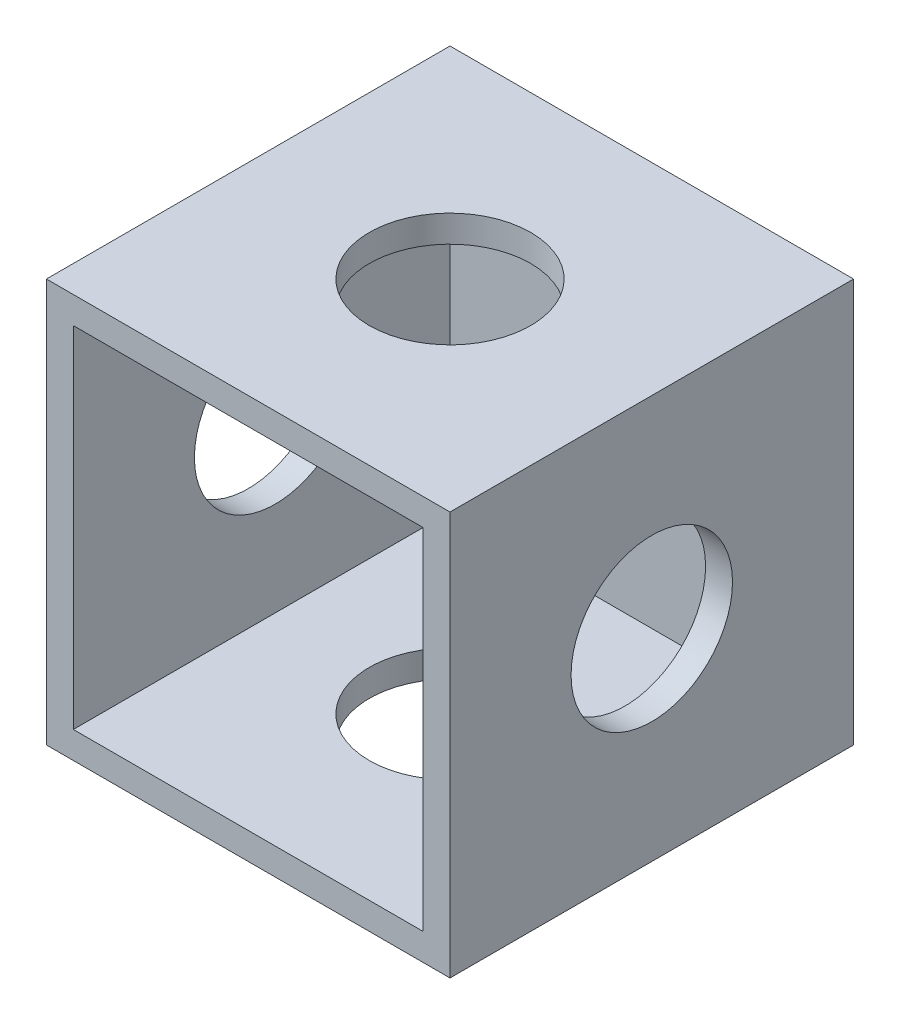
ISO-10303-21;
HEADER;
FILE_DESCRIPTION(('STEP AP214'),'2;1');
FILE_NAME('part.step','',(''),(''),'','','');
FILE_SCHEMA(('AUTOMOTIVE_DESIGN { 1 0 10303 214 1 1 1 1 }'));
ENDSEC;
DATA;
#1=APPLICATION_CONTEXT('core data for automotive mechanical design processes');
#2=APPLICATION_PROTOCOL_DEFINITION('international standard','automotive_design',2000,#1);
#3=PRODUCT_CONTEXT('',#1,'mechanical');
#4=PRODUCT('Part','Part','',(#3));
#5=PRODUCT_RELATED_PRODUCT_CATEGORY('part','',(#4));
#6=PRODUCT_DEFINITION_FORMATION('','',#4);
#7=PRODUCT_DEFINITION_CONTEXT('part definition',#1,'design');
#8=PRODUCT_DEFINITION('design','',#6,#7);
#9=PRODUCT_DEFINITION_SHAPE('','',#8);
#10=(LENGTH_UNIT() NAMED_UNIT(*) SI_UNIT(.MILLI.,.METRE.));
#11=(NAMED_UNIT(*) PLANE_ANGLE_UNIT() SI_UNIT($,.RADIAN.));
#12=(NAMED_UNIT(*) SI_UNIT($,.STERADIAN.) SOLID_ANGLE_UNIT());
#13=UNCERTAINTY_MEASURE_WITH_UNIT(LENGTH_MEASURE(1.E-05),#10,'distance_accuracy_value','');
#14=(GEOMETRIC_REPRESENTATION_CONTEXT(3) GLOBAL_UNCERTAINTY_ASSIGNED_CONTEXT((#13)) GLOBAL_UNIT_ASSIGNED_CONTEXT((#10,
#11,#12)) REPRESENTATION_CONTEXT('',''));
#15=CARTESIAN_POINT('',(0.,0.,0.));
#16=DIRECTION('',(0.,0.,1.));
#17=DIRECTION('',(1.,0.,0.));
#18=AXIS2_PLACEMENT_3D('',#15,#16,#17);
#19=CARTESIAN_POINT('',(0.,0.,30.));
#20=DIRECTION('',(0.,0.,-1.));
#21=DIRECTION('',(-1.,0.,0.));
#22=AXIS2_PLACEMENT_3D('',#19,#20,#21);
#23=PLANE('',#22);
#24=DIRECTION('',(1.,0.,0.));
#25=VECTOR('',#24,1.);
#26=CARTESIAN_POINT('',(15.,-15.,30.));
#27=LINE('',#26,#25);
#28=CARTESIAN_POINT('',(-15.,-15.,30.));
#29=VERTEX_POINT('',#28);
#30=CARTESIAN_POINT('',(15.,-15.,30.));
#31=VERTEX_POINT('',#30);
#32=EDGE_CURVE('E149',#29,#31,#27,.T.);
#33=ORIENTED_EDGE('',*,*,#32,.T.);
#34=DIRECTION('',(0.,1.,0.));
#35=VECTOR('',#34,1.);
#36=CARTESIAN_POINT('',(15.,-15.,30.));
#37=LINE('',#36,#35);
#38=CARTESIAN_POINT('',(15.,15.,30.));
#39=VERTEX_POINT('',#38);
#40=EDGE_CURVE('E93',#31,#39,#37,.T.);
#41=ORIENTED_EDGE('',*,*,#40,.T.);
#42=DIRECTION('',(-1.,0.,0.));
#43=VECTOR('',#42,1.);
#44=CARTESIAN_POINT('',(15.,15.,30.));
#45=LINE('',#44,#43);
#46=CARTESIAN_POINT('',(-15.,15.,30.));
#47=VERTEX_POINT('',#46);
#48=EDGE_CURVE('E152',#39,#47,#45,.T.);
#49=ORIENTED_EDGE('',*,*,#48,.T.);
#50=DIRECTION('',(0.,-1.,0.));
#51=VECTOR('',#50,1.);
#52=CARTESIAN_POINT('',(-15.,-15.,30.));
#53=LINE('',#52,#51);
#54=EDGE_CURVE('E65',#47,#29,#53,.T.);
#55=ORIENTED_EDGE('',*,*,#54,.T.);
#56=EDGE_LOOP('',(#33,#41,#49,#55));
#57=FACE_BOUND('',#56,.T.);
#58=DIRECTION('',(1.,0.,0.));
#59=VECTOR('',#58,1.);
#60=CARTESIAN_POINT('',(0.,-13.,30.));
#61=LINE('',#60,#59);
#62=CARTESIAN_POINT('',(-13.,-13.,30.));
#63=VERTEX_POINT('',#62);
#64=CARTESIAN_POINT('',(13.,-13.,30.));
#65=VERTEX_POINT('',#64);
#66=EDGE_CURVE('E138',#63,#65,#61,.T.);
#67=ORIENTED_EDGE('',*,*,#66,.F.);
#68=DIRECTION('',(0.,-1.,0.));
#69=VECTOR('',#68,1.);
#70=CARTESIAN_POINT('',(-13.,0.,30.));
#71=LINE('',#70,#69);
#72=CARTESIAN_POINT('',(-13.,13.,30.));
#73=VERTEX_POINT('',#72);
#74=EDGE_CURVE('E147',#73,#63,#71,.T.);
#75=ORIENTED_EDGE('',*,*,#74,.F.);
#76=DIRECTION('',(-1.,0.,0.));
#77=VECTOR('',#76,1.);
#78=CARTESIAN_POINT('',(0.,13.,30.));
#79=LINE('',#78,#77);
#80=CARTESIAN_POINT('',(13.,13.,30.));
#81=VERTEX_POINT('',#80);
#82=EDGE_CURVE('E145',#81,#73,#79,.T.);
#83=ORIENTED_EDGE('',*,*,#82,.F.);
#84=DIRECTION('',(0.,1.,0.));
#85=VECTOR('',#84,1.);
#86=CARTESIAN_POINT('',(13.,0.,30.));
#87=LINE('',#86,#85);
#88=EDGE_CURVE('E130',#65,#81,#87,.T.);
#89=ORIENTED_EDGE('',*,*,#88,.F.);
#90=EDGE_LOOP('',(#67,#75,#83,#89));
#91=FACE_BOUND('',#90,.T.);
#92=ADVANCED_FACE('F39',(#57,#91),#23,.F.);
#93=CARTESIAN_POINT('',(15.,-15.,30.));
#94=DIRECTION('',(0.,1.,0.));
#95=DIRECTION('',(0.,0.,1.));
#96=AXIS2_PLACEMENT_3D('',#93,#94,#95);
#97=PLANE('',#96);
#98=CARTESIAN_POINT('',(0.,-15.,15.));
#99=DIRECTION('',(0.,1.,0.));
#100=DIRECTION('',(0.,0.,1.));
#101=AXIS2_PLACEMENT_3D('',#98,#99,#100);
#102=CIRCLE('',#101,6.);
#103=CARTESIAN_POINT('',(0.,-15.,21.));
#104=VERTEX_POINT('',#103);
#105=EDGE_CURVE('E175',#104,#104,#102,.T.);
#106=ORIENTED_EDGE('',*,*,#105,.T.);
#107=EDGE_LOOP('',(#106));
#108=FACE_BOUND('',#107,.T.);
#109=DIRECTION('',(1.,0.,0.));
#110=VECTOR('',#109,1.);
#111=CARTESIAN_POINT('',(15.,-15.,0.));
#112=LINE('',#111,#110);
#113=CARTESIAN_POINT('',(-15.,-15.,0.));
#114=VERTEX_POINT('',#113);
#115=CARTESIAN_POINT('',(15.,-15.,0.));
#116=VERTEX_POINT('',#115);
#117=EDGE_CURVE('E156',#114,#116,#112,.T.);
#118=ORIENTED_EDGE('',*,*,#117,.T.);
#119=DIRECTION('',(0.,0.,-1.));
#120=VECTOR('',#119,1.);
#121=CARTESIAN_POINT('',(15.,-15.,30.));
#122=LINE('',#121,#120);
#123=EDGE_CURVE('E11',#31,#116,#122,.T.);
#124=ORIENTED_EDGE('',*,*,#123,.F.);
#125=ORIENTED_EDGE('',*,*,#32,.F.);
#126=DIRECTION('',(0.,0.,-1.));
#127=VECTOR('',#126,1.);
#128=CARTESIAN_POINT('',(-15.,-15.,30.));
#129=LINE('',#128,#127);
#130=EDGE_CURVE('E155',#29,#114,#129,.T.);
#131=ORIENTED_EDGE('',*,*,#130,.T.);
#132=EDGE_LOOP('',(#118,#124,#125,#131));
#133=FACE_BOUND('',#132,.T.);
#134=ADVANCED_FACE('F41',(#108,#133),#97,.F.);
#135=CARTESIAN_POINT('',(15.,-15.,30.));
#136=DIRECTION('',(-1.,0.,0.));
#137=DIRECTION('',(0.,0.,1.));
#138=AXIS2_PLACEMENT_3D('',#135,#136,#137);
#139=PLANE('',#138);
#140=CARTESIAN_POINT('',(15.,0.,15.));
#141=DIRECTION('',(1.,0.,0.));
#142=DIRECTION('',(0.,0.,-1.));
#143=AXIS2_PLACEMENT_3D('',#140,#141,#142);
#144=CIRCLE('',#143,6.);
#145=CARTESIAN_POINT('',(15.,0.,9.));
#146=VERTEX_POINT('',#145);
#147=EDGE_CURVE('E228',#146,#146,#144,.T.);
#148=ORIENTED_EDGE('',*,*,#147,.F.);
#149=EDGE_LOOP('',(#148));
#150=FACE_BOUND('',#149,.T.);
#151=DIRECTION('',(0.,1.,0.));
#152=VECTOR('',#151,1.);
#153=CARTESIAN_POINT('',(15.,-15.,0.));
#154=LINE('',#153,#152);
#155=CARTESIAN_POINT('',(15.,15.,0.));
#156=VERTEX_POINT('',#155);
#157=EDGE_CURVE('E159',#116,#156,#154,.T.);
#158=ORIENTED_EDGE('',*,*,#157,.T.);
#159=DIRECTION('',(0.,0.,-1.));
#160=VECTOR('',#159,1.);
#161=CARTESIAN_POINT('',(15.,15.,30.));
#162=LINE('',#161,#160);
#163=EDGE_CURVE('E48',#39,#156,#162,.T.);
#164=ORIENTED_EDGE('',*,*,#163,.F.);
#165=ORIENTED_EDGE('',*,*,#40,.F.);
#166=ORIENTED_EDGE('',*,*,#123,.T.);
#167=EDGE_LOOP('',(#158,#164,#165,#166));
#168=FACE_BOUND('',#167,.T.);
#169=ADVANCED_FACE('F206',(#150,#168),#139,.F.);
#170=CARTESIAN_POINT('',(15.,15.,30.));
#171=DIRECTION('',(0.,-1.,0.));
#172=DIRECTION('',(0.,0.,-1.));
#173=AXIS2_PLACEMENT_3D('',#170,#171,#172);
#174=PLANE('',#173);
#175=CARTESIAN_POINT('',(0.,15.,15.));
#176=DIRECTION('',(0.,1.,0.));
#177=DIRECTION('',(0.,0.,1.));
#178=AXIS2_PLACEMENT_3D('',#175,#176,#177);
#179=CIRCLE('',#178,6.);
#180=CARTESIAN_POINT('',(0.,15.,21.));
#181=VERTEX_POINT('',#180);
#182=EDGE_CURVE('E171',#181,#181,#179,.T.);
#183=ORIENTED_EDGE('',*,*,#182,.F.);
#184=EDGE_LOOP('',(#183));
#185=FACE_BOUND('',#184,.T.);
#186=DIRECTION('',(-1.,0.,0.));
#187=VECTOR('',#186,1.);
#188=CARTESIAN_POINT('',(15.,15.,0.));
#189=LINE('',#188,#187);
#190=CARTESIAN_POINT('',(-15.,15.,0.));
#191=VERTEX_POINT('',#190);
#192=EDGE_CURVE('E161',#156,#191,#189,.T.);
#193=ORIENTED_EDGE('',*,*,#192,.T.);
#194=DIRECTION('',(0.,0.,-1.));
#195=VECTOR('',#194,1.);
#196=CARTESIAN_POINT('',(-15.,15.,30.));
#197=LINE('',#196,#195);
#198=EDGE_CURVE('E165',#47,#191,#197,.T.);
#199=ORIENTED_EDGE('',*,*,#198,.F.);
#200=ORIENTED_EDGE('',*,*,#48,.F.);
#201=ORIENTED_EDGE('',*,*,#163,.T.);
#202=EDGE_LOOP('',(#193,#199,#200,#201));
#203=FACE_BOUND('',#202,.T.);
#204=ADVANCED_FACE('F217',(#185,#203),#174,.F.);
#205=CARTESIAN_POINT('',(-15.,-15.,30.));
#206=DIRECTION('',(1.,0.,0.));
#207=DIRECTION('',(0.,0.,-1.));
#208=AXIS2_PLACEMENT_3D('',#205,#206,#207);
#209=PLANE('',#208);
#210=CARTESIAN_POINT('',(-15.,0.,15.));
#211=DIRECTION('',(1.,0.,0.));
#212=DIRECTION('',(0.,0.,-1.));
#213=AXIS2_PLACEMENT_3D('',#210,#211,#212);
#214=CIRCLE('',#213,6.);
#215=CARTESIAN_POINT('',(-15.,0.,9.));
#216=VERTEX_POINT('',#215);
#217=EDGE_CURVE('E178',#216,#216,#214,.T.);
#218=ORIENTED_EDGE('',*,*,#217,.T.);
#219=EDGE_LOOP('',(#218));
#220=FACE_BOUND('',#219,.T.);
#221=DIRECTION('',(0.,-1.,0.));
#222=VECTOR('',#221,1.);
#223=CARTESIAN_POINT('',(-15.,-15.,0.));
#224=LINE('',#223,#222);
#225=EDGE_CURVE('E86',#191,#114,#224,.T.);
#226=ORIENTED_EDGE('',*,*,#225,.T.);
#227=ORIENTED_EDGE('',*,*,#130,.F.);
#228=ORIENTED_EDGE('',*,*,#54,.F.);
#229=ORIENTED_EDGE('',*,*,#198,.T.);
#230=EDGE_LOOP('',(#226,#227,#228,#229));
#231=FACE_BOUND('',#230,.T.);
#232=ADVANCED_FACE('F213',(#220,#231),#209,.F.);
#233=CARTESIAN_POINT('',(0.,0.,0.));
#234=DIRECTION('',(0.,0.,-1.));
#235=DIRECTION('',(-1.,0.,0.));
#236=AXIS2_PLACEMENT_3D('',#233,#234,#235);
#237=PLANE('',#236);
#238=ORIENTED_EDGE('',*,*,#117,.F.);
#239=ORIENTED_EDGE('',*,*,#225,.F.);
#240=ORIENTED_EDGE('',*,*,#192,.F.);
#241=ORIENTED_EDGE('',*,*,#157,.F.);
#242=EDGE_LOOP('',(#238,#239,#240,#241));
#243=FACE_BOUND('',#242,.T.);
#244=ADVANCED_FACE('F211',(#243),#237,.T.);
#245=CARTESIAN_POINT('',(15.,-13.,30.));
#246=DIRECTION('',(0.,1.,0.));
#247=DIRECTION('',(0.,0.,1.));
#248=AXIS2_PLACEMENT_3D('',#245,#246,#247);
#249=PLANE('',#248);
#250=CARTESIAN_POINT('',(0.,-13.,15.));
#251=DIRECTION('',(0.,1.,0.));
#252=DIRECTION('',(0.,0.,1.));
#253=AXIS2_PLACEMENT_3D('',#250,#251,#252);
#254=CIRCLE('',#253,6.);
#255=CARTESIAN_POINT('',(0.,-13.,21.));
#256=VERTEX_POINT('',#255);
#257=EDGE_CURVE('E170',#256,#256,#254,.T.);
#258=ORIENTED_EDGE('',*,*,#257,.F.);
#259=EDGE_LOOP('',(#258));
#260=FACE_BOUND('',#259,.T.);
#261=DIRECTION('',(1.,0.,0.));
#262=VECTOR('',#261,1.);
#263=CARTESIAN_POINT('',(0.,-13.,2.));
#264=LINE('',#263,#262);
#265=CARTESIAN_POINT('',(-13.,-13.,2.));
#266=VERTEX_POINT('',#265);
#267=CARTESIAN_POINT('',(13.,-13.,2.));
#268=VERTEX_POINT('',#267);
#269=EDGE_CURVE('E121',#266,#268,#264,.T.);
#270=ORIENTED_EDGE('',*,*,#269,.F.);
#271=DIRECTION('',(0.,0.,-1.));
#272=VECTOR('',#271,1.);
#273=CARTESIAN_POINT('',(-13.,-13.,30.));
#274=LINE('',#273,#272);
#275=EDGE_CURVE('E141',#63,#266,#274,.T.);
#276=ORIENTED_EDGE('',*,*,#275,.F.);
#277=ORIENTED_EDGE('',*,*,#66,.T.);
#278=DIRECTION('',(0.,0.,-1.));
#279=VECTOR('',#278,1.);
#280=CARTESIAN_POINT('',(13.,-13.,30.));
#281=LINE('',#280,#279);
#282=EDGE_CURVE('E133',#65,#268,#281,.T.);
#283=ORIENTED_EDGE('',*,*,#282,.T.);
#284=EDGE_LOOP('',(#270,#276,#277,#283));
#285=FACE_BOUND('',#284,.T.);
#286=ADVANCED_FACE('F197',(#260,#285),#249,.T.);
#287=CARTESIAN_POINT('',(13.,-15.,30.));
#288=DIRECTION('',(-1.,0.,0.));
#289=DIRECTION('',(0.,0.,1.));
#290=AXIS2_PLACEMENT_3D('',#287,#288,#289);
#291=PLANE('',#290);
#292=CARTESIAN_POINT('',(13.,0.,15.));
#293=DIRECTION('',(-1.,0.,0.));
#294=DIRECTION('',(0.,0.,1.));
#295=AXIS2_PLACEMENT_3D('',#292,#293,#294);
#296=CIRCLE('',#295,6.);
#297=CARTESIAN_POINT('',(13.,0.,21.));
#298=VERTEX_POINT('',#297);
#299=EDGE_CURVE('E183',#298,#298,#296,.T.);
#300=ORIENTED_EDGE('',*,*,#299,.F.);
#301=EDGE_LOOP('',(#300));
#302=FACE_BOUND('',#301,.T.);
#303=DIRECTION('',(0.,1.,0.));
#304=VECTOR('',#303,1.);
#305=CARTESIAN_POINT('',(13.,0.,2.));
#306=LINE('',#305,#304);
#307=CARTESIAN_POINT('',(13.,13.,2.));
#308=VERTEX_POINT('',#307);
#309=EDGE_CURVE('E115',#268,#308,#306,.T.);
#310=ORIENTED_EDGE('',*,*,#309,.F.);
#311=ORIENTED_EDGE('',*,*,#282,.F.);
#312=ORIENTED_EDGE('',*,*,#88,.T.);
#313=DIRECTION('',(0.,0.,-1.));
#314=VECTOR('',#313,1.);
#315=CARTESIAN_POINT('',(13.,13.,30.));
#316=LINE('',#315,#314);
#317=EDGE_CURVE('E127',#81,#308,#316,.T.);
#318=ORIENTED_EDGE('',*,*,#317,.T.);
#319=EDGE_LOOP('',(#310,#311,#312,#318));
#320=FACE_BOUND('',#319,.T.);
#321=ADVANCED_FACE('F128',(#302,#320),#291,.T.);
#322=CARTESIAN_POINT('',(15.,13.,30.));
#323=DIRECTION('',(0.,-1.,0.));
#324=DIRECTION('',(0.,0.,-1.));
#325=AXIS2_PLACEMENT_3D('',#322,#323,#324);
#326=PLANE('',#325);
#327=CARTESIAN_POINT('',(0.,13.,15.));
#328=DIRECTION('',(0.,-1.,0.));
#329=DIRECTION('',(0.,0.,-1.));
#330=AXIS2_PLACEMENT_3D('',#327,#328,#329);
#331=CIRCLE('',#330,6.);
#332=CARTESIAN_POINT('',(0.,13.,9.));
#333=VERTEX_POINT('',#332);
#334=EDGE_CURVE('E168',#333,#333,#331,.T.);
#335=ORIENTED_EDGE('',*,*,#334,.F.);
#336=EDGE_LOOP('',(#335));
#337=FACE_BOUND('',#336,.T.);
#338=DIRECTION('',(-1.,0.,0.));
#339=VECTOR('',#338,1.);
#340=CARTESIAN_POINT('',(0.,13.,2.));
#341=LINE('',#340,#339);
#342=CARTESIAN_POINT('',(-13.,13.,2.));
#343=VERTEX_POINT('',#342);
#344=EDGE_CURVE('E119',#308,#343,#341,.T.);
#345=ORIENTED_EDGE('',*,*,#344,.F.);
#346=ORIENTED_EDGE('',*,*,#317,.F.);
#347=ORIENTED_EDGE('',*,*,#82,.T.);
#348=DIRECTION('',(0.,0.,-1.));
#349=VECTOR('',#348,1.);
#350=CARTESIAN_POINT('',(-13.,13.,30.));
#351=LINE('',#350,#349);
#352=EDGE_CURVE('E56',#73,#343,#351,.T.);
#353=ORIENTED_EDGE('',*,*,#352,.T.);
#354=EDGE_LOOP('',(#345,#346,#347,#353));
#355=FACE_BOUND('',#354,.T.);
#356=ADVANCED_FACE('F135',(#337,#355),#326,.T.);
#357=CARTESIAN_POINT('',(-13.,-15.,30.));
#358=DIRECTION('',(1.,0.,0.));
#359=DIRECTION('',(0.,0.,-1.));
#360=AXIS2_PLACEMENT_3D('',#357,#358,#359);
#361=PLANE('',#360);
#362=CARTESIAN_POINT('',(-13.,0.,15.));
#363=DIRECTION('',(1.,0.,0.));
#364=DIRECTION('',(0.,0.,-1.));
#365=AXIS2_PLACEMENT_3D('',#362,#363,#364);
#366=CIRCLE('',#365,6.);
#367=CARTESIAN_POINT('',(-13.,0.,9.));
#368=VERTEX_POINT('',#367);
#369=EDGE_CURVE('E43',#368,#368,#366,.T.);
#370=ORIENTED_EDGE('',*,*,#369,.F.);
#371=EDGE_LOOP('',(#370));
#372=FACE_BOUND('',#371,.T.);
#373=DIRECTION('',(0.,-1.,0.));
#374=VECTOR('',#373,1.);
#375=CARTESIAN_POINT('',(-13.,0.,2.));
#376=LINE('',#375,#374);
#377=EDGE_CURVE('E136',#343,#266,#376,.T.);
#378=ORIENTED_EDGE('',*,*,#377,.F.);
#379=ORIENTED_EDGE('',*,*,#352,.F.);
#380=ORIENTED_EDGE('',*,*,#74,.T.);
#381=ORIENTED_EDGE('',*,*,#275,.T.);
#382=EDGE_LOOP('',(#378,#379,#380,#381));
#383=FACE_BOUND('',#382,.T.);
#384=ADVANCED_FACE('F193',(#372,#383),#361,.T.);
#385=CARTESIAN_POINT('',(0.,0.,2.));
#386=DIRECTION('',(0.,0.,-1.));
#387=DIRECTION('',(-1.,0.,0.));
#388=AXIS2_PLACEMENT_3D('',#385,#386,#387);
#389=PLANE('',#388);
#390=ORIENTED_EDGE('',*,*,#269,.T.);
#391=ORIENTED_EDGE('',*,*,#309,.T.);
#392=ORIENTED_EDGE('',*,*,#344,.T.);
#393=ORIENTED_EDGE('',*,*,#377,.T.);
#394=EDGE_LOOP('',(#390,#391,#392,#393));
#395=FACE_BOUND('',#394,.T.);
#396=ADVANCED_FACE('F117',(#395),#389,.F.);
#397=CARTESIAN_POINT('',(0.,-25.,15.));
#398=DIRECTION('',(0.,1.,0.));
#399=DIRECTION('',(0.,0.,1.));
#400=AXIS2_PLACEMENT_3D('',#397,#398,#399);
#401=CYLINDRICAL_SURFACE('',#400,6.);
#402=ORIENTED_EDGE('',*,*,#334,.T.);
#403=EDGE_LOOP('',(#402));
#404=FACE_BOUND('',#403,.T.);
#405=ORIENTED_EDGE('',*,*,#182,.T.);
#406=EDGE_LOOP('',(#405));
#407=FACE_BOUND('',#406,.T.);
#408=ADVANCED_FACE('F261',(#404,#407),#401,.F.);
#409=ORIENTED_EDGE('',*,*,#257,.T.);
#410=EDGE_LOOP('',(#409));
#411=FACE_BOUND('',#410,.T.);
#412=ORIENTED_EDGE('',*,*,#105,.F.);
#413=EDGE_LOOP('',(#412));
#414=FACE_BOUND('',#413,.T.);
#415=ADVANCED_FACE('F266',(#411,#414),#401,.F.);
#416=CARTESIAN_POINT('',(-25.,0.,15.));
#417=DIRECTION('',(1.,0.,0.));
#418=DIRECTION('',(0.,0.,-1.));
#419=AXIS2_PLACEMENT_3D('',#416,#417,#418);
#420=CYLINDRICAL_SURFACE('',#419,6.);
#421=ORIENTED_EDGE('',*,*,#369,.T.);
#422=EDGE_LOOP('',(#421));
#423=FACE_BOUND('',#422,.T.);
#424=ORIENTED_EDGE('',*,*,#217,.F.);
#425=EDGE_LOOP('',(#424));
#426=FACE_BOUND('',#425,.T.);
#427=ADVANCED_FACE('F264',(#423,#426),#420,.F.);
#428=ORIENTED_EDGE('',*,*,#299,.T.);
#429=EDGE_LOOP('',(#428));
#430=FACE_BOUND('',#429,.T.);
#431=ORIENTED_EDGE('',*,*,#147,.T.);
#432=EDGE_LOOP('',(#431));
#433=FACE_BOUND('',#432,.T.);
#434=ADVANCED_FACE('F243',(#430,#433),#420,.F.);
#435=CLOSED_SHELL('',(#92,#134,#169,#204,#232,#244,#286,#321,#356,#384,#396,#408,#415,#427,#434));
#436=MANIFOLD_SOLID_BREP('B2',#435);
#437=ADVANCED_BREP_SHAPE_REPRESENTATION('',(#18,#436),#14);
#438=SHAPE_DEFINITION_REPRESENTATION(#9,#437);
ENDSEC;
END-ISO-10303-21;
